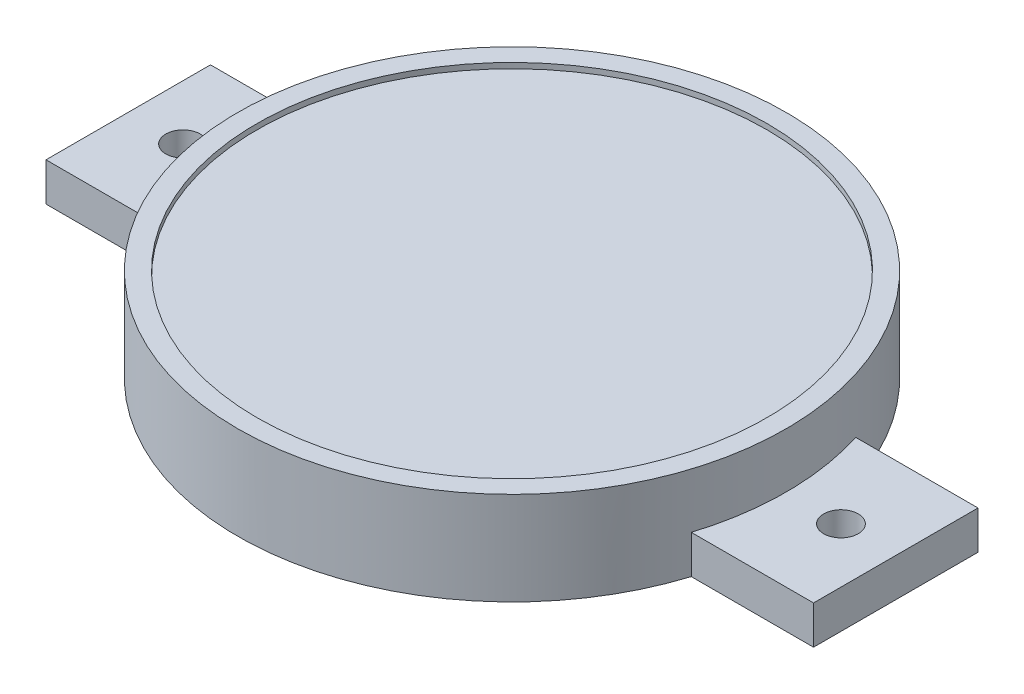
ISO-10303-21;
HEADER;
FILE_DESCRIPTION(('STEP AP214'),'2;1');
FILE_NAME('part.step','',(''),(''),'','','');
FILE_SCHEMA(('AUTOMOTIVE_DESIGN { 1 0 10303 214 1 1 1 1 }'));
ENDSEC;
DATA;
#1=APPLICATION_CONTEXT('core data for automotive mechanical design processes');
#2=APPLICATION_PROTOCOL_DEFINITION('international standard','automotive_design',2000,#1);
#3=PRODUCT_CONTEXT('',#1,'mechanical');
#4=PRODUCT('Part','Part','',(#3));
#5=PRODUCT_RELATED_PRODUCT_CATEGORY('part','',(#4));
#6=PRODUCT_DEFINITION_FORMATION('','',#4);
#7=PRODUCT_DEFINITION_CONTEXT('part definition',#1,'design');
#8=PRODUCT_DEFINITION('design','',#6,#7);
#9=PRODUCT_DEFINITION_SHAPE('','',#8);
#10=(LENGTH_UNIT() NAMED_UNIT(*) SI_UNIT(.MILLI.,.METRE.));
#11=(NAMED_UNIT(*) PLANE_ANGLE_UNIT() SI_UNIT($,.RADIAN.));
#12=(NAMED_UNIT(*) SI_UNIT($,.STERADIAN.) SOLID_ANGLE_UNIT());
#13=UNCERTAINTY_MEASURE_WITH_UNIT(LENGTH_MEASURE(1.E-05),#10,'distance_accuracy_value','');
#14=(GEOMETRIC_REPRESENTATION_CONTEXT(3) GLOBAL_UNCERTAINTY_ASSIGNED_CONTEXT((#13)) GLOBAL_UNIT_ASSIGNED_CONTEXT((#10,
#11,#12)) REPRESENTATION_CONTEXT('',''));
#15=CARTESIAN_POINT('',(0.,0.,0.));
#16=DIRECTION('',(0.,0.,1.));
#17=DIRECTION('',(1.,0.,0.));
#18=AXIS2_PLACEMENT_3D('',#15,#16,#17);
#19=CARTESIAN_POINT('',(0.,16.,0.));
#20=DIRECTION('',(0.,-1.,0.));
#21=DIRECTION('',(0.,0.,-1.));
#22=AXIS2_PLACEMENT_3D('',#19,#20,#21);
#23=CYLINDRICAL_SURFACE('',#22,50.);
#24=CARTESIAN_POINT('',(0.,17.,0.));
#25=DIRECTION('',(0.,1.,0.));
#26=DIRECTION('',(0.,0.,1.));
#27=AXIS2_PLACEMENT_3D('',#24,#25,#26);
#28=CIRCLE('',#27,50.);
#29=CARTESIAN_POINT('',(0.,17.,50.));
#30=VERTEX_POINT('',#29);
#31=EDGE_CURVE('E209',#30,#30,#28,.T.);
#32=ORIENTED_EDGE('',*,*,#31,.F.);
#33=EDGE_LOOP('',(#32));
#34=FACE_BOUND('',#33,.T.);
#35=DIRECTION('',(0.,-1.,0.));
#36=VECTOR('',#35,1.);
#37=CARTESIAN_POINT('',(47.6969600708473,7.,15.));
#38=LINE('',#37,#36);
#39=CARTESIAN_POINT('',(47.6969600708473,7.,15.));
#40=VERTEX_POINT('',#39);
#41=CARTESIAN_POINT('',(47.6969600708473,0.,15.));
#42=VERTEX_POINT('',#41);
#43=EDGE_CURVE('E54',#40,#42,#38,.T.);
#44=ORIENTED_EDGE('',*,*,#43,.F.);
#45=CARTESIAN_POINT('',(0.,7.,0.));
#46=DIRECTION('',(0.,-1.,0.));
#47=DIRECTION('',(0.,0.,1.));
#48=AXIS2_PLACEMENT_3D('',#45,#46,#47);
#49=CIRCLE('',#48,50.);
#50=CARTESIAN_POINT('',(47.6969600708473,7.,-15.));
#51=VERTEX_POINT('',#50);
#52=EDGE_CURVE('E59',#51,#40,#49,.T.);
#53=ORIENTED_EDGE('',*,*,#52,.F.);
#54=DIRECTION('',(0.,-1.,0.));
#55=VECTOR('',#54,1.);
#56=CARTESIAN_POINT('',(47.6969600708473,7.,-15.));
#57=LINE('',#56,#55);
#58=CARTESIAN_POINT('',(47.6969600708473,0.,-15.));
#59=VERTEX_POINT('',#58);
#60=EDGE_CURVE('E129',#51,#59,#57,.T.);
#61=ORIENTED_EDGE('',*,*,#60,.T.);
#62=CARTESIAN_POINT('',(0.,0.,0.));
#63=DIRECTION('',(0.,1.,0.));
#64=DIRECTION('',(0.,0.,1.));
#65=AXIS2_PLACEMENT_3D('',#62,#63,#64);
#66=CIRCLE('',#65,50.);
#67=CARTESIAN_POINT('',(-47.6969600708473,0.,-15.));
#68=VERTEX_POINT('',#67);
#69=EDGE_CURVE('E212',#59,#68,#66,.T.);
#70=ORIENTED_EDGE('',*,*,#69,.T.);
#71=DIRECTION('',(0.,-1.,0.));
#72=VECTOR('',#71,1.);
#73=CARTESIAN_POINT('',(-47.6969600708473,7.,-15.));
#74=LINE('',#73,#72);
#75=CARTESIAN_POINT('',(-47.6969600708473,7.,-15.));
#76=VERTEX_POINT('',#75);
#77=EDGE_CURVE('E193',#76,#68,#74,.T.);
#78=ORIENTED_EDGE('',*,*,#77,.F.);
#79=CARTESIAN_POINT('',(0.,7.,0.));
#80=DIRECTION('',(0.,-1.,0.));
#81=DIRECTION('',(0.,0.,-1.));
#82=AXIS2_PLACEMENT_3D('',#79,#80,#81);
#83=CIRCLE('',#82,50.);
#84=CARTESIAN_POINT('',(-47.6969600708473,7.,15.));
#85=VERTEX_POINT('',#84);
#86=EDGE_CURVE('E158',#85,#76,#83,.T.);
#87=ORIENTED_EDGE('',*,*,#86,.F.);
#88=DIRECTION('',(0.,-1.,0.));
#89=VECTOR('',#88,1.);
#90=CARTESIAN_POINT('',(-47.6969600708473,7.,15.));
#91=LINE('',#90,#89);
#92=CARTESIAN_POINT('',(-47.6969600708473,0.,15.));
#93=VERTEX_POINT('',#92);
#94=EDGE_CURVE('E173',#85,#93,#91,.T.);
#95=ORIENTED_EDGE('',*,*,#94,.T.);
#96=EDGE_CURVE('E47',#93,#42,#66,.T.);
#97=ORIENTED_EDGE('',*,*,#96,.T.);
#98=EDGE_LOOP('',(#44,#53,#61,#70,#78,#87,#95,#97));
#99=FACE_BOUND('',#98,.T.);
#100=ADVANCED_FACE('F39',(#34,#99),#23,.T.);
#101=CARTESIAN_POINT('',(0.,0.,0.));
#102=DIRECTION('',(0.,1.,0.));
#103=DIRECTION('',(0.,0.,1.));
#104=AXIS2_PLACEMENT_3D('',#101,#102,#103);
#105=PLANE('',#104);
#106=CARTESIAN_POINT('',(0.,0.,0.));
#107=DIRECTION('',(0.,-1.,0.));
#108=DIRECTION('',(0.,0.,-1.));
#109=AXIS2_PLACEMENT_3D('',#106,#107,#108);
#110=CIRCLE('',#109,47.);
#111=CARTESIAN_POINT('',(0.,0.,-47.));
#112=VERTEX_POINT('',#111);
#113=EDGE_CURVE('E197',#112,#112,#110,.T.);
#114=ORIENTED_EDGE('',*,*,#113,.F.);
#115=EDGE_LOOP('',(#114));
#116=FACE_BOUND('',#115,.T.);
#117=ORIENTED_EDGE('',*,*,#96,.F.);
#118=DIRECTION('',(1.,0.,0.));
#119=VECTOR('',#118,1.);
#120=CARTESIAN_POINT('',(-47.6969600708473,0.,15.));
#121=LINE('',#120,#119);
#122=CARTESIAN_POINT('',(-70.,0.,15.));
#123=VERTEX_POINT('',#122);
#124=EDGE_CURVE('E163',#123,#93,#121,.T.);
#125=ORIENTED_EDGE('',*,*,#124,.F.);
#126=DIRECTION('',(0.,0.,1.));
#127=VECTOR('',#126,1.);
#128=CARTESIAN_POINT('',(-70.,0.,-15.));
#129=LINE('',#128,#127);
#130=CARTESIAN_POINT('',(-70.,0.,-15.));
#131=VERTEX_POINT('',#130);
#132=EDGE_CURVE('E176',#131,#123,#129,.T.);
#133=ORIENTED_EDGE('',*,*,#132,.F.);
#134=DIRECTION('',(-1.,0.,0.));
#135=VECTOR('',#134,1.);
#136=CARTESIAN_POINT('',(-47.6969600708473,0.,-15.));
#137=LINE('',#136,#135);
#138=EDGE_CURVE('E154',#68,#131,#137,.T.);
#139=ORIENTED_EDGE('',*,*,#138,.F.);
#140=ORIENTED_EDGE('',*,*,#69,.F.);
#141=DIRECTION('',(-1.,0.,0.));
#142=VECTOR('',#141,1.);
#143=CARTESIAN_POINT('',(47.6969600708473,0.,-15.));
#144=LINE('',#143,#142);
#145=CARTESIAN_POINT('',(70.,0.,-15.));
#146=VERTEX_POINT('',#145);
#147=EDGE_CURVE('E139',#146,#59,#144,.T.);
#148=ORIENTED_EDGE('',*,*,#147,.F.);
#149=DIRECTION('',(0.,0.,-1.));
#150=VECTOR('',#149,1.);
#151=CARTESIAN_POINT('',(70.,0.,-15.));
#152=LINE('',#151,#150);
#153=CARTESIAN_POINT('',(70.,0.,15.));
#154=VERTEX_POINT('',#153);
#155=EDGE_CURVE('E135',#154,#146,#152,.T.);
#156=ORIENTED_EDGE('',*,*,#155,.F.);
#157=DIRECTION('',(1.,0.,0.));
#158=VECTOR('',#157,1.);
#159=CARTESIAN_POINT('',(47.6969600708473,0.,15.));
#160=LINE('',#159,#158);
#161=EDGE_CURVE('E116',#42,#154,#160,.T.);
#162=ORIENTED_EDGE('',*,*,#161,.F.);
#163=EDGE_LOOP('',(#117,#125,#133,#139,#140,#148,#156,#162));
#164=FACE_BOUND('',#163,.T.);
#165=CARTESIAN_POINT('',(-60.,0.,0.));
#166=DIRECTION('',(0.,1.,0.));
#167=DIRECTION('',(0.,0.,1.));
#168=AXIS2_PLACEMENT_3D('',#165,#166,#167);
#169=CIRCLE('',#168,3.15);
#170=CARTESIAN_POINT('',(-60.,0.,3.15));
#171=VERTEX_POINT('',#170);
#172=EDGE_CURVE('E149',#171,#171,#169,.T.);
#173=ORIENTED_EDGE('',*,*,#172,.T.);
#174=EDGE_LOOP('',(#173));
#175=FACE_BOUND('',#174,.T.);
#176=CARTESIAN_POINT('',(60.,0.,0.));
#177=DIRECTION('',(0.,1.,0.));
#178=DIRECTION('',(0.,0.,-1.));
#179=AXIS2_PLACEMENT_3D('',#176,#177,#178);
#180=CIRCLE('',#179,3.15);
#181=CARTESIAN_POINT('',(60.,0.,-3.15));
#182=VERTEX_POINT('',#181);
#183=EDGE_CURVE('E410',#182,#182,#180,.T.);
#184=ORIENTED_EDGE('',*,*,#183,.T.);
#185=EDGE_LOOP('',(#184));
#186=FACE_BOUND('',#185,.T.);
#187=ADVANCED_FACE('F221',(#116,#164,#175,#186),#105,.F.);
#188=CARTESIAN_POINT('',(0.,17.,0.));
#189=DIRECTION('',(0.,1.,0.));
#190=DIRECTION('',(0.,0.,1.));
#191=AXIS2_PLACEMENT_3D('',#188,#189,#190);
#192=PLANE('',#191);
#193=ORIENTED_EDGE('',*,*,#31,.T.);
#194=EDGE_LOOP('',(#193));
#195=FACE_BOUND('',#194,.T.);
#196=CARTESIAN_POINT('',(0.,17.,0.));
#197=DIRECTION('',(0.,1.,0.));
#198=DIRECTION('',(0.,0.,1.));
#199=AXIS2_PLACEMENT_3D('',#196,#197,#198);
#200=CIRCLE('',#199,46.5);
#201=CARTESIAN_POINT('',(0.,17.,46.5));
#202=VERTEX_POINT('',#201);
#203=EDGE_CURVE('E202',#202,#202,#200,.T.);
#204=ORIENTED_EDGE('',*,*,#203,.F.);
#205=EDGE_LOOP('',(#204));
#206=FACE_BOUND('',#205,.T.);
#207=ADVANCED_FACE('F254',(#195,#206),#192,.T.);
#208=CARTESIAN_POINT('',(0.,17.,0.));
#209=DIRECTION('',(0.,-1.,0.));
#210=DIRECTION('',(0.,0.,-1.));
#211=AXIS2_PLACEMENT_3D('',#208,#209,#210);
#212=CYLINDRICAL_SURFACE('',#211,46.5);
#213=ORIENTED_EDGE('',*,*,#203,.T.);
#214=EDGE_LOOP('',(#213));
#215=FACE_BOUND('',#214,.T.);
#216=CARTESIAN_POINT('',(0.,16.,0.));
#217=DIRECTION('',(0.,1.,0.));
#218=DIRECTION('',(0.,0.,1.));
#219=AXIS2_PLACEMENT_3D('',#216,#217,#218);
#220=CIRCLE('',#219,46.5);
#221=CARTESIAN_POINT('',(0.,16.,46.5));
#222=VERTEX_POINT('',#221);
#223=EDGE_CURVE('E11',#222,#222,#220,.F.);
#224=ORIENTED_EDGE('',*,*,#223,.T.);
#225=EDGE_LOOP('',(#224));
#226=FACE_BOUND('',#225,.T.);
#227=ADVANCED_FACE('F260',(#215,#226),#212,.F.);
#228=CARTESIAN_POINT('',(0.,16.,0.));
#229=DIRECTION('',(0.,1.,0.));
#230=DIRECTION('',(0.,0.,1.));
#231=AXIS2_PLACEMENT_3D('',#228,#229,#230);
#232=PLANE('',#231);
#233=ORIENTED_EDGE('',*,*,#223,.F.);
#234=EDGE_LOOP('',(#233));
#235=FACE_BOUND('',#234,.T.);
#236=ADVANCED_FACE('F266',(#235),#232,.T.);
#237=CARTESIAN_POINT('',(0.,10.,0.));
#238=DIRECTION('',(0.,-1.,0.));
#239=DIRECTION('',(0.,0.,-1.));
#240=AXIS2_PLACEMENT_3D('',#237,#238,#239);
#241=CYLINDRICAL_SURFACE('',#240,47.);
#242=CARTESIAN_POINT('',(0.,10.,0.));
#243=DIRECTION('',(0.,-1.,0.));
#244=DIRECTION('',(0.,0.,-1.));
#245=AXIS2_PLACEMENT_3D('',#242,#243,#244);
#246=CIRCLE('',#245,47.);
#247=CARTESIAN_POINT('',(0.,10.,-47.));
#248=VERTEX_POINT('',#247);
#249=EDGE_CURVE('E198',#248,#248,#246,.T.);
#250=ORIENTED_EDGE('',*,*,#249,.F.);
#251=EDGE_LOOP('',(#250));
#252=FACE_BOUND('',#251,.T.);
#253=ORIENTED_EDGE('',*,*,#113,.T.);
#254=EDGE_LOOP('',(#253));
#255=FACE_BOUND('',#254,.T.);
#256=ADVANCED_FACE('F271',(#252,#255),#241,.F.);
#257=CARTESIAN_POINT('',(0.,10.,0.));
#258=DIRECTION('',(0.,-1.,0.));
#259=DIRECTION('',(0.,0.,-1.));
#260=AXIS2_PLACEMENT_3D('',#257,#258,#259);
#261=PLANE('',#260);
#262=ORIENTED_EDGE('',*,*,#249,.T.);
#263=EDGE_LOOP('',(#262));
#264=FACE_BOUND('',#263,.T.);
#265=ADVANCED_FACE('F276',(#264),#261,.T.);
#266=CARTESIAN_POINT('',(0.,7.,0.));
#267=DIRECTION('',(0.,-1.,0.));
#268=DIRECTION('',(0.,0.,-1.));
#269=AXIS2_PLACEMENT_3D('',#266,#267,#268);
#270=PLANE('',#269);
#271=ORIENTED_EDGE('',*,*,#86,.T.);
#272=DIRECTION('',(-1.,0.,0.));
#273=VECTOR('',#272,1.);
#274=CARTESIAN_POINT('',(-47.6969600708473,7.,-15.));
#275=LINE('',#274,#273);
#276=CARTESIAN_POINT('',(-70.,7.,-15.));
#277=VERTEX_POINT('',#276);
#278=EDGE_CURVE('E162',#76,#277,#275,.T.);
#279=ORIENTED_EDGE('',*,*,#278,.T.);
#280=DIRECTION('',(0.,0.,1.));
#281=VECTOR('',#280,1.);
#282=CARTESIAN_POINT('',(-70.,7.,-15.));
#283=LINE('',#282,#281);
#284=CARTESIAN_POINT('',(-70.,7.,15.));
#285=VERTEX_POINT('',#284);
#286=EDGE_CURVE('E166',#277,#285,#283,.T.);
#287=ORIENTED_EDGE('',*,*,#286,.T.);
#288=DIRECTION('',(1.,0.,0.));
#289=VECTOR('',#288,1.);
#290=CARTESIAN_POINT('',(-47.6969600708473,7.,15.));
#291=LINE('',#290,#289);
#292=EDGE_CURVE('E169',#285,#85,#291,.T.);
#293=ORIENTED_EDGE('',*,*,#292,.T.);
#294=EDGE_LOOP('',(#271,#279,#287,#293));
#295=FACE_BOUND('',#294,.T.);
#296=CARTESIAN_POINT('',(-60.,7.,0.));
#297=DIRECTION('',(0.,1.,0.));
#298=DIRECTION('',(0.,0.,1.));
#299=AXIS2_PLACEMENT_3D('',#296,#297,#298);
#300=CIRCLE('',#299,3.15);
#301=CARTESIAN_POINT('',(-60.,7.,3.15));
#302=VERTEX_POINT('',#301);
#303=EDGE_CURVE('E150',#302,#302,#300,.T.);
#304=ORIENTED_EDGE('',*,*,#303,.F.);
#305=EDGE_LOOP('',(#304));
#306=FACE_BOUND('',#305,.T.);
#307=ADVANCED_FACE('F229',(#295,#306),#270,.F.);
#308=CARTESIAN_POINT('',(-47.6969600708473,7.,-15.));
#309=DIRECTION('',(0.,0.,1.));
#310=DIRECTION('',(1.,0.,0.));
#311=AXIS2_PLACEMENT_3D('',#308,#309,#310);
#312=PLANE('',#311);
#313=ORIENTED_EDGE('',*,*,#138,.T.);
#314=DIRECTION('',(0.,-1.,0.));
#315=VECTOR('',#314,1.);
#316=CARTESIAN_POINT('',(-70.,7.,-15.));
#317=LINE('',#316,#315);
#318=EDGE_CURVE('E189',#277,#131,#317,.T.);
#319=ORIENTED_EDGE('',*,*,#318,.F.);
#320=ORIENTED_EDGE('',*,*,#278,.F.);
#321=ORIENTED_EDGE('',*,*,#77,.T.);
#322=EDGE_LOOP('',(#313,#319,#320,#321));
#323=FACE_BOUND('',#322,.T.);
#324=ADVANCED_FACE('F226',(#323),#312,.F.);
#325=CARTESIAN_POINT('',(-70.,7.,-15.));
#326=DIRECTION('',(1.,0.,0.));
#327=DIRECTION('',(0.,0.,-1.));
#328=AXIS2_PLACEMENT_3D('',#325,#326,#327);
#329=PLANE('',#328);
#330=ORIENTED_EDGE('',*,*,#132,.T.);
#331=DIRECTION('',(0.,-1.,0.));
#332=VECTOR('',#331,1.);
#333=CARTESIAN_POINT('',(-70.,7.,15.));
#334=LINE('',#333,#332);
#335=EDGE_CURVE('E185',#285,#123,#334,.T.);
#336=ORIENTED_EDGE('',*,*,#335,.F.);
#337=ORIENTED_EDGE('',*,*,#286,.F.);
#338=ORIENTED_EDGE('',*,*,#318,.T.);
#339=EDGE_LOOP('',(#330,#336,#337,#338));
#340=FACE_BOUND('',#339,.T.);
#341=ADVANCED_FACE('F285',(#340),#329,.F.);
#342=CARTESIAN_POINT('',(-47.6969600708473,7.,15.));
#343=DIRECTION('',(0.,0.,-1.));
#344=DIRECTION('',(-1.,0.,0.));
#345=AXIS2_PLACEMENT_3D('',#342,#343,#344);
#346=PLANE('',#345);
#347=ORIENTED_EDGE('',*,*,#124,.T.);
#348=ORIENTED_EDGE('',*,*,#94,.F.);
#349=ORIENTED_EDGE('',*,*,#292,.F.);
#350=ORIENTED_EDGE('',*,*,#335,.T.);
#351=EDGE_LOOP('',(#347,#348,#349,#350));
#352=FACE_BOUND('',#351,.T.);
#353=ADVANCED_FACE('F234',(#352),#346,.F.);
#354=CARTESIAN_POINT('',(-60.,7.,0.));
#355=DIRECTION('',(0.,-1.,0.));
#356=DIRECTION('',(0.,0.,-1.));
#357=AXIS2_PLACEMENT_3D('',#354,#355,#356);
#358=CYLINDRICAL_SURFACE('',#357,3.15);
#359=ORIENTED_EDGE('',*,*,#303,.T.);
#360=EDGE_LOOP('',(#359));
#361=FACE_BOUND('',#360,.T.);
#362=ORIENTED_EDGE('',*,*,#172,.F.);
#363=EDGE_LOOP('',(#362));
#364=FACE_BOUND('',#363,.T.);
#365=ADVANCED_FACE('F291',(#361,#364),#358,.F.);
#366=CARTESIAN_POINT('',(0.,7.,0.));
#367=DIRECTION('',(0.,1.,0.));
#368=DIRECTION('',(0.,0.,1.));
#369=AXIS2_PLACEMENT_3D('',#366,#367,#368);
#370=PLANE('',#369);
#371=ORIENTED_EDGE('',*,*,#52,.T.);
#372=DIRECTION('',(1.,0.,0.));
#373=VECTOR('',#372,1.);
#374=CARTESIAN_POINT('',(47.6969600708473,7.,15.));
#375=LINE('',#374,#373);
#376=CARTESIAN_POINT('',(70.,7.,15.));
#377=VERTEX_POINT('',#376);
#378=EDGE_CURVE('E102',#40,#377,#375,.T.);
#379=ORIENTED_EDGE('',*,*,#378,.T.);
#380=DIRECTION('',(0.,0.,-1.));
#381=VECTOR('',#380,1.);
#382=CARTESIAN_POINT('',(70.,7.,-15.));
#383=LINE('',#382,#381);
#384=CARTESIAN_POINT('',(70.,7.,-15.));
#385=VERTEX_POINT('',#384);
#386=EDGE_CURVE('E107',#377,#385,#383,.T.);
#387=ORIENTED_EDGE('',*,*,#386,.T.);
#388=DIRECTION('',(-1.,0.,0.));
#389=VECTOR('',#388,1.);
#390=CARTESIAN_POINT('',(47.6969600708473,7.,-15.));
#391=LINE('',#390,#389);
#392=EDGE_CURVE('E126',#385,#51,#391,.T.);
#393=ORIENTED_EDGE('',*,*,#392,.T.);
#394=EDGE_LOOP('',(#371,#379,#387,#393));
#395=FACE_BOUND('',#394,.T.);
#396=CARTESIAN_POINT('',(60.,7.,0.));
#397=DIRECTION('',(0.,1.,0.));
#398=DIRECTION('',(0.,0.,-1.));
#399=AXIS2_PLACEMENT_3D('',#396,#397,#398);
#400=CIRCLE('',#399,3.15);
#401=CARTESIAN_POINT('',(60.,7.,-3.15));
#402=VERTEX_POINT('',#401);
#403=EDGE_CURVE('E136',#402,#402,#400,.T.);
#404=ORIENTED_EDGE('',*,*,#403,.F.);
#405=EDGE_LOOP('',(#404));
#406=FACE_BOUND('',#405,.T.);
#407=ADVANCED_FACE('F104',(#395,#406),#370,.T.);
#408=CARTESIAN_POINT('',(47.6969600708473,7.,15.));
#409=DIRECTION('',(0.,0.,-1.));
#410=DIRECTION('',(-1.,0.,0.));
#411=AXIS2_PLACEMENT_3D('',#408,#409,#410);
#412=PLANE('',#411);
#413=ORIENTED_EDGE('',*,*,#161,.T.);
#414=DIRECTION('',(0.,-1.,0.));
#415=VECTOR('',#414,1.);
#416=CARTESIAN_POINT('',(70.,7.,15.));
#417=LINE('',#416,#415);
#418=EDGE_CURVE('E113',#377,#154,#417,.T.);
#419=ORIENTED_EDGE('',*,*,#418,.F.);
#420=ORIENTED_EDGE('',*,*,#378,.F.);
#421=ORIENTED_EDGE('',*,*,#43,.T.);
#422=EDGE_LOOP('',(#413,#419,#420,#421));
#423=FACE_BOUND('',#422,.T.);
#424=ADVANCED_FACE('F114',(#423),#412,.F.);
#425=CARTESIAN_POINT('',(70.,7.,-15.));
#426=DIRECTION('',(-1.,0.,0.));
#427=DIRECTION('',(0.,0.,1.));
#428=AXIS2_PLACEMENT_3D('',#425,#426,#427);
#429=PLANE('',#428);
#430=ORIENTED_EDGE('',*,*,#155,.T.);
#431=DIRECTION('',(0.,-1.,0.));
#432=VECTOR('',#431,1.);
#433=CARTESIAN_POINT('',(70.,7.,-15.));
#434=LINE('',#433,#432);
#435=EDGE_CURVE('E120',#385,#146,#434,.T.);
#436=ORIENTED_EDGE('',*,*,#435,.F.);
#437=ORIENTED_EDGE('',*,*,#386,.F.);
#438=ORIENTED_EDGE('',*,*,#418,.T.);
#439=EDGE_LOOP('',(#430,#436,#437,#438));
#440=FACE_BOUND('',#439,.T.);
#441=ADVANCED_FACE('F122',(#440),#429,.F.);
#442=CARTESIAN_POINT('',(47.6969600708473,7.,-15.));
#443=DIRECTION('',(0.,0.,1.));
#444=DIRECTION('',(1.,0.,0.));
#445=AXIS2_PLACEMENT_3D('',#442,#443,#444);
#446=PLANE('',#445);
#447=ORIENTED_EDGE('',*,*,#147,.T.);
#448=ORIENTED_EDGE('',*,*,#60,.F.);
#449=ORIENTED_EDGE('',*,*,#392,.F.);
#450=ORIENTED_EDGE('',*,*,#435,.T.);
#451=EDGE_LOOP('',(#447,#448,#449,#450));
#452=FACE_BOUND('',#451,.T.);
#453=ADVANCED_FACE('F237',(#452),#446,.F.);
#454=CARTESIAN_POINT('',(60.,7.,0.));
#455=DIRECTION('',(0.,-1.,0.));
#456=DIRECTION('',(0.,0.,-1.));
#457=AXIS2_PLACEMENT_3D('',#454,#455,#456);
#458=CYLINDRICAL_SURFACE('',#457,3.15);
#459=ORIENTED_EDGE('',*,*,#403,.T.);
#460=EDGE_LOOP('',(#459));
#461=FACE_BOUND('',#460,.T.);
#462=ORIENTED_EDGE('',*,*,#183,.F.);
#463=EDGE_LOOP('',(#462));
#464=FACE_BOUND('',#463,.T.);
#465=ADVANCED_FACE('F239',(#461,#464),#458,.F.);
#466=CLOSED_SHELL('',(#100,#187,#207,#227,#236,#256,#265,#307,#324,#341,#353,#365,#407,#424,
#441,#453,#465));
#467=MANIFOLD_SOLID_BREP('B2',#466);
#468=ADVANCED_BREP_SHAPE_REPRESENTATION('',(#18,#467),#14);
#469=SHAPE_DEFINITION_REPRESENTATION(#9,#468);
ENDSEC;
END-ISO-10303-21;
